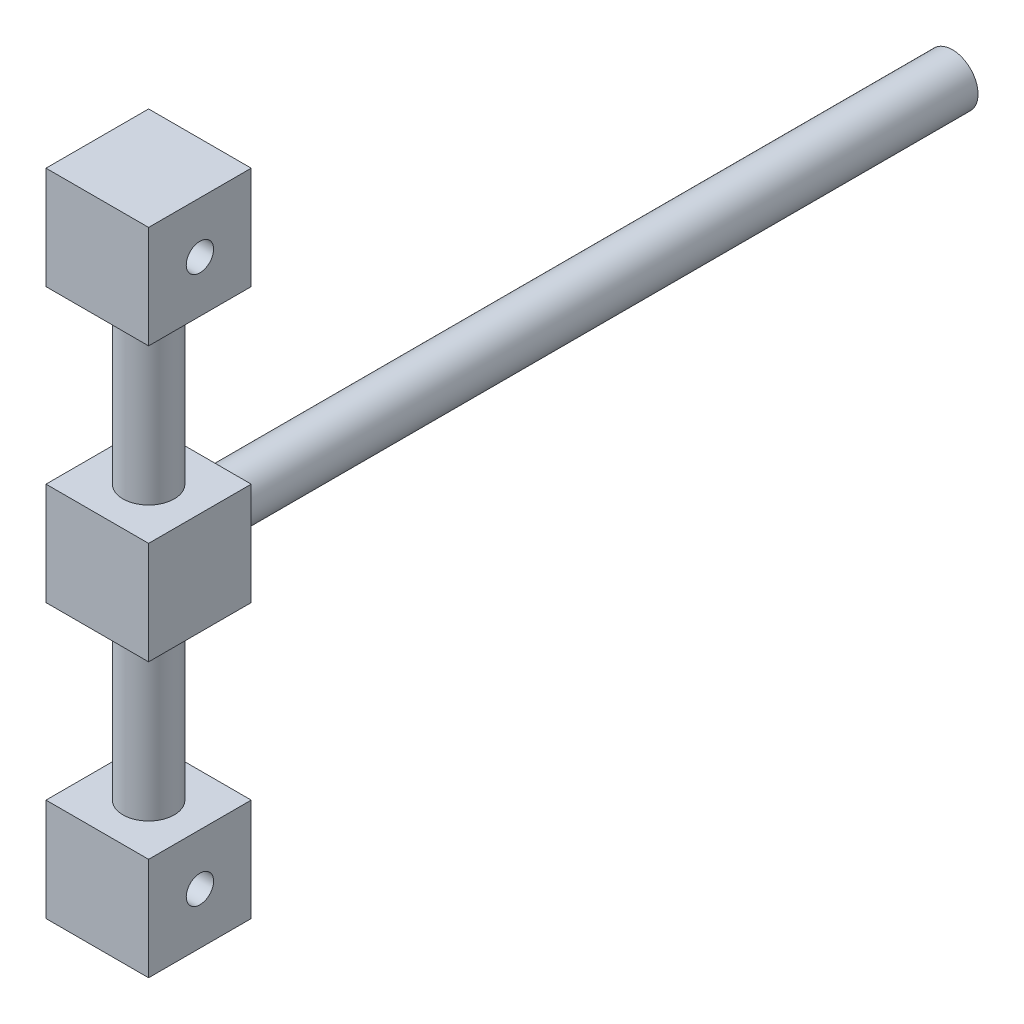
ISO-10303-21;
HEADER;
FILE_DESCRIPTION(('STEP AP214'),'2;1');
FILE_NAME('part.step','',(''),(''),'','','');
FILE_SCHEMA(('AUTOMOTIVE_DESIGN { 1 0 10303 214 1 1 1 1 }'));
ENDSEC;
DATA;
#1=APPLICATION_CONTEXT('core data for automotive mechanical design processes');
#2=APPLICATION_PROTOCOL_DEFINITION('international standard','automotive_design',2000,#1);
#3=PRODUCT_CONTEXT('',#1,'mechanical');
#4=PRODUCT('Part','Part','',(#3));
#5=PRODUCT_RELATED_PRODUCT_CATEGORY('part','',(#4));
#6=PRODUCT_DEFINITION_FORMATION('','',#4);
#7=PRODUCT_DEFINITION_CONTEXT('part definition',#1,'design');
#8=PRODUCT_DEFINITION('design','',#6,#7);
#9=PRODUCT_DEFINITION_SHAPE('','',#8);
#10=(LENGTH_UNIT() NAMED_UNIT(*) SI_UNIT(.MILLI.,.METRE.));
#11=(NAMED_UNIT(*) PLANE_ANGLE_UNIT() SI_UNIT($,.RADIAN.));
#12=(NAMED_UNIT(*) SI_UNIT($,.STERADIAN.) SOLID_ANGLE_UNIT());
#13=UNCERTAINTY_MEASURE_WITH_UNIT(LENGTH_MEASURE(1.E-05),#10,'distance_accuracy_value','');
#14=(GEOMETRIC_REPRESENTATION_CONTEXT(3) GLOBAL_UNCERTAINTY_ASSIGNED_CONTEXT((#13)) GLOBAL_UNIT_ASSIGNED_CONTEXT((#10,
#11,#12)) REPRESENTATION_CONTEXT('',''));
#15=CARTESIAN_POINT('',(0.,0.,0.));
#16=DIRECTION('',(0.,0.,1.));
#17=DIRECTION('',(1.,0.,0.));
#18=AXIS2_PLACEMENT_3D('',#15,#16,#17);
#19=CARTESIAN_POINT('',(-15.,-15.,30.));
#20=DIRECTION('',(1.,0.,0.));
#21=DIRECTION('',(0.,0.,-1.));
#22=AXIS2_PLACEMENT_3D('',#19,#20,#21);
#23=PLANE('',#22);
#24=DIRECTION('',(0.,-1.,0.));
#25=VECTOR('',#24,1.);
#26=CARTESIAN_POINT('',(-15.,-15.,0.));
#27=LINE('',#26,#25);
#28=CARTESIAN_POINT('',(-15.,15.,0.));
#29=VERTEX_POINT('',#28);
#30=CARTESIAN_POINT('',(-15.,-15.,0.));
#31=VERTEX_POINT('',#30);
#32=EDGE_CURVE('E226',#29,#31,#27,.T.);
#33=ORIENTED_EDGE('',*,*,#32,.T.);
#34=DIRECTION('',(0.,0.,-1.));
#35=VECTOR('',#34,1.);
#36=CARTESIAN_POINT('',(-15.,-15.,30.));
#37=LINE('',#36,#35);
#38=CARTESIAN_POINT('',(-15.,-15.,30.));
#39=VERTEX_POINT('',#38);
#40=EDGE_CURVE('E36',#39,#31,#37,.T.);
#41=ORIENTED_EDGE('',*,*,#40,.F.);
#42=DIRECTION('',(0.,-1.,0.));
#43=VECTOR('',#42,1.);
#44=CARTESIAN_POINT('',(-15.,-15.,30.));
#45=LINE('',#44,#43);
#46=CARTESIAN_POINT('',(-15.,15.,30.));
#47=VERTEX_POINT('',#46);
#48=EDGE_CURVE('E229',#47,#39,#45,.T.);
#49=ORIENTED_EDGE('',*,*,#48,.F.);
#50=DIRECTION('',(0.,0.,-1.));
#51=VECTOR('',#50,1.);
#52=CARTESIAN_POINT('',(-15.,15.,30.));
#53=LINE('',#52,#51);
#54=EDGE_CURVE('E235',#47,#29,#53,.T.);
#55=ORIENTED_EDGE('',*,*,#54,.T.);
#56=EDGE_LOOP('',(#33,#41,#49,#55));
#57=FACE_BOUND('',#56,.T.);
#58=ADVANCED_FACE('F33',(#57),#23,.F.);
#59=CARTESIAN_POINT('',(15.,-15.,30.));
#60=DIRECTION('',(0.,1.,0.));
#61=DIRECTION('',(-1.,0.,0.));
#62=AXIS2_PLACEMENT_3D('',#59,#60,#61);
#63=PLANE('',#62);
#64=CARTESIAN_POINT('',(0.,-15.,15.));
#65=DIRECTION('',(0.,-1.,0.));
#66=DIRECTION('',(1.,0.,0.));
#67=AXIS2_PLACEMENT_3D('',#64,#65,#66);
#68=CIRCLE('',#67,7.5);
#69=CARTESIAN_POINT('',(7.5,-15.,15.));
#70=VERTEX_POINT('',#69);
#71=EDGE_CURVE('E11',#70,#70,#68,.T.);
#72=ORIENTED_EDGE('',*,*,#71,.F.);
#73=EDGE_LOOP('',(#72));
#74=FACE_BOUND('',#73,.T.);
#75=DIRECTION('',(1.,0.,0.));
#76=VECTOR('',#75,1.);
#77=CARTESIAN_POINT('',(15.,-15.,0.));
#78=LINE('',#77,#76);
#79=CARTESIAN_POINT('',(15.,-15.,0.));
#80=VERTEX_POINT('',#79);
#81=EDGE_CURVE('E238',#31,#80,#78,.T.);
#82=ORIENTED_EDGE('',*,*,#81,.T.);
#83=DIRECTION('',(0.,0.,-1.));
#84=VECTOR('',#83,1.);
#85=CARTESIAN_POINT('',(15.,-15.,30.));
#86=LINE('',#85,#84);
#87=CARTESIAN_POINT('',(15.,-15.,30.));
#88=VERTEX_POINT('',#87);
#89=EDGE_CURVE('E244',#88,#80,#86,.T.);
#90=ORIENTED_EDGE('',*,*,#89,.F.);
#91=DIRECTION('',(1.,0.,0.));
#92=VECTOR('',#91,1.);
#93=CARTESIAN_POINT('',(15.,-15.,30.));
#94=LINE('',#93,#92);
#95=EDGE_CURVE('E83',#39,#88,#94,.T.);
#96=ORIENTED_EDGE('',*,*,#95,.F.);
#97=ORIENTED_EDGE('',*,*,#40,.T.);
#98=EDGE_LOOP('',(#82,#90,#96,#97));
#99=FACE_BOUND('',#98,.T.);
#100=ADVANCED_FACE('F247',(#74,#99),#63,.F.);
#101=CARTESIAN_POINT('',(15.,-15.,30.));
#102=DIRECTION('',(-1.,0.,0.));
#103=DIRECTION('',(0.,0.,1.));
#104=AXIS2_PLACEMENT_3D('',#101,#102,#103);
#105=PLANE('',#104);
#106=DIRECTION('',(0.,1.,0.));
#107=VECTOR('',#106,1.);
#108=CARTESIAN_POINT('',(15.,-15.,0.));
#109=LINE('',#108,#107);
#110=CARTESIAN_POINT('',(15.,15.,0.));
#111=VERTEX_POINT('',#110);
#112=EDGE_CURVE('E69',#80,#111,#109,.T.);
#113=ORIENTED_EDGE('',*,*,#112,.T.);
#114=DIRECTION('',(0.,0.,-1.));
#115=VECTOR('',#114,1.);
#116=CARTESIAN_POINT('',(15.,15.,30.));
#117=LINE('',#116,#115);
#118=CARTESIAN_POINT('',(15.,15.,30.));
#119=VERTEX_POINT('',#118);
#120=EDGE_CURVE('E243',#119,#111,#117,.T.);
#121=ORIENTED_EDGE('',*,*,#120,.F.);
#122=DIRECTION('',(0.,1.,0.));
#123=VECTOR('',#122,1.);
#124=CARTESIAN_POINT('',(15.,-15.,30.));
#125=LINE('',#124,#123);
#126=EDGE_CURVE('E232',#88,#119,#125,.T.);
#127=ORIENTED_EDGE('',*,*,#126,.F.);
#128=ORIENTED_EDGE('',*,*,#89,.T.);
#129=EDGE_LOOP('',(#113,#121,#127,#128));
#130=FACE_BOUND('',#129,.T.);
#131=ADVANCED_FACE('F273',(#130),#105,.F.);
#132=CARTESIAN_POINT('',(15.,15.,30.));
#133=DIRECTION('',(0.,-1.,0.));
#134=DIRECTION('',(1.,0.,0.));
#135=AXIS2_PLACEMENT_3D('',#132,#133,#134);
#136=PLANE('',#135);
#137=CARTESIAN_POINT('',(0.,15.,15.));
#138=DIRECTION('',(0.,-1.,0.));
#139=DIRECTION('',(1.,0.,0.));
#140=AXIS2_PLACEMENT_3D('',#137,#138,#139);
#141=CIRCLE('',#140,7.5);
#142=CARTESIAN_POINT('',(7.5,15.,15.));
#143=VERTEX_POINT('',#142);
#144=EDGE_CURVE('E181',#143,#143,#141,.T.);
#145=ORIENTED_EDGE('',*,*,#144,.T.);
#146=EDGE_LOOP('',(#145));
#147=FACE_BOUND('',#146,.T.);
#148=DIRECTION('',(-1.,0.,0.));
#149=VECTOR('',#148,1.);
#150=CARTESIAN_POINT('',(15.,15.,0.));
#151=LINE('',#150,#149);
#152=EDGE_CURVE('E75',#111,#29,#151,.T.);
#153=ORIENTED_EDGE('',*,*,#152,.T.);
#154=ORIENTED_EDGE('',*,*,#54,.F.);
#155=DIRECTION('',(-1.,0.,0.));
#156=VECTOR('',#155,1.);
#157=CARTESIAN_POINT('',(15.,15.,30.));
#158=LINE('',#157,#156);
#159=EDGE_CURVE('E51',#119,#47,#158,.T.);
#160=ORIENTED_EDGE('',*,*,#159,.F.);
#161=ORIENTED_EDGE('',*,*,#120,.T.);
#162=EDGE_LOOP('',(#153,#154,#160,#161));
#163=FACE_BOUND('',#162,.T.);
#164=ADVANCED_FACE('F265',(#147,#163),#136,.F.);
#165=CARTESIAN_POINT('',(0.,0.,30.));
#166=DIRECTION('',(0.,0.,1.));
#167=DIRECTION('',(1.,0.,0.));
#168=AXIS2_PLACEMENT_3D('',#165,#166,#167);
#169=PLANE('',#168);
#170=ORIENTED_EDGE('',*,*,#48,.T.);
#171=ORIENTED_EDGE('',*,*,#95,.T.);
#172=ORIENTED_EDGE('',*,*,#126,.T.);
#173=ORIENTED_EDGE('',*,*,#159,.T.);
#174=EDGE_LOOP('',(#170,#171,#172,#173));
#175=FACE_BOUND('',#174,.T.);
#176=ADVANCED_FACE('F255',(#175),#169,.T.);
#177=CARTESIAN_POINT('',(0.,0.,0.));
#178=DIRECTION('',(0.,0.,1.));
#179=DIRECTION('',(1.,0.,0.));
#180=AXIS2_PLACEMENT_3D('',#177,#178,#179);
#181=PLANE('',#180);
#182=CARTESIAN_POINT('',(0.,0.,0.));
#183=DIRECTION('',(0.,0.,-1.));
#184=DIRECTION('',(-1.,0.,0.));
#185=AXIS2_PLACEMENT_3D('',#182,#183,#184);
#186=CIRCLE('',#185,7.5);
#187=CARTESIAN_POINT('',(-7.5,0.,0.));
#188=VERTEX_POINT('',#187);
#189=EDGE_CURVE('E42',#188,#188,#186,.T.);
#190=ORIENTED_EDGE('',*,*,#189,.F.);
#191=EDGE_LOOP('',(#190));
#192=FACE_BOUND('',#191,.T.);
#193=ORIENTED_EDGE('',*,*,#32,.F.);
#194=ORIENTED_EDGE('',*,*,#152,.F.);
#195=ORIENTED_EDGE('',*,*,#112,.F.);
#196=ORIENTED_EDGE('',*,*,#81,.F.);
#197=EDGE_LOOP('',(#193,#194,#195,#196));
#198=FACE_BOUND('',#197,.T.);
#199=ADVANCED_FACE('F252',(#192,#198),#181,.F.);
#200=CARTESIAN_POINT('',(0.,0.,-220.));
#201=DIRECTION('',(0.,0.,1.));
#202=DIRECTION('',(1.,0.,0.));
#203=AXIS2_PLACEMENT_3D('',#200,#201,#202);
#204=CYLINDRICAL_SURFACE('',#203,7.5);
#205=CARTESIAN_POINT('',(0.,0.,-220.));
#206=DIRECTION('',(0.,0.,-1.));
#207=DIRECTION('',(-1.,0.,0.));
#208=AXIS2_PLACEMENT_3D('',#205,#206,#207);
#209=CIRCLE('',#208,7.5);
#210=CARTESIAN_POINT('',(-7.5,0.,-220.));
#211=VERTEX_POINT('',#210);
#212=EDGE_CURVE('E222',#211,#211,#209,.T.);
#213=ORIENTED_EDGE('',*,*,#212,.F.);
#214=EDGE_LOOP('',(#213));
#215=FACE_BOUND('',#214,.T.);
#216=ORIENTED_EDGE('',*,*,#189,.T.);
#217=EDGE_LOOP('',(#216));
#218=FACE_BOUND('',#217,.T.);
#219=ADVANCED_FACE('F254',(#215,#218),#204,.T.);
#220=CARTESIAN_POINT('',(0.,0.,-220.));
#221=DIRECTION('',(0.,0.,-1.));
#222=DIRECTION('',(-1.,0.,0.));
#223=AXIS2_PLACEMENT_3D('',#220,#221,#222);
#224=PLANE('',#223);
#225=ORIENTED_EDGE('',*,*,#212,.T.);
#226=EDGE_LOOP('',(#225));
#227=FACE_BOUND('',#226,.T.);
#228=ADVANCED_FACE('F262',(#227),#224,.T.);
#229=CARTESIAN_POINT('',(0.,-65.,15.));
#230=DIRECTION('',(0.,1.,0.));
#231=DIRECTION('',(-1.,0.,0.));
#232=AXIS2_PLACEMENT_3D('',#229,#230,#231);
#233=CYLINDRICAL_SURFACE('',#232,7.5);
#234=CARTESIAN_POINT('',(0.,-65.,15.));
#235=DIRECTION('',(0.,-1.,0.));
#236=DIRECTION('',(1.,0.,0.));
#237=AXIS2_PLACEMENT_3D('',#234,#235,#236);
#238=CIRCLE('',#237,7.5);
#239=CARTESIAN_POINT('',(7.50000000000001,-65.,15.));
#240=VERTEX_POINT('',#239);
#241=EDGE_CURVE('E220',#240,#240,#238,.T.);
#242=ORIENTED_EDGE('',*,*,#241,.F.);
#243=EDGE_LOOP('',(#242));
#244=FACE_BOUND('',#243,.T.);
#245=ORIENTED_EDGE('',*,*,#71,.T.);
#246=EDGE_LOOP('',(#245));
#247=FACE_BOUND('',#246,.T.);
#248=ADVANCED_FACE('F324',(#244,#247),#233,.T.);
#249=CARTESIAN_POINT('',(15.,-95.,30.));
#250=DIRECTION('',(-1.,0.,0.));
#251=DIRECTION('',(0.,-1.,0.));
#252=AXIS2_PLACEMENT_3D('',#249,#250,#251);
#253=PLANE('',#252);
#254=CARTESIAN_POINT('',(15.,-80.,15.));
#255=DIRECTION('',(-1.,0.,0.));
#256=DIRECTION('',(0.,-1.,0.));
#257=AXIS2_PLACEMENT_3D('',#254,#255,#256);
#258=CIRCLE('',#257,4.);
#259=CARTESIAN_POINT('',(15.,-84.,15.));
#260=VERTEX_POINT('',#259);
#261=EDGE_CURVE('E185',#260,#260,#258,.T.);
#262=ORIENTED_EDGE('',*,*,#261,.T.);
#263=EDGE_LOOP('',(#262));
#264=FACE_BOUND('',#263,.T.);
#265=DIRECTION('',(0.,0.,1.));
#266=VECTOR('',#265,1.);
#267=CARTESIAN_POINT('',(15.,-65.,30.));
#268=LINE('',#267,#266);
#269=CARTESIAN_POINT('',(15.,-65.,0.));
#270=VERTEX_POINT('',#269);
#271=CARTESIAN_POINT('',(15.,-65.,30.));
#272=VERTEX_POINT('',#271);
#273=EDGE_CURVE('E188',#270,#272,#268,.T.);
#274=ORIENTED_EDGE('',*,*,#273,.T.);
#275=DIRECTION('',(0.,1.,0.));
#276=VECTOR('',#275,1.);
#277=CARTESIAN_POINT('',(15.,-95.,30.));
#278=LINE('',#277,#276);
#279=CARTESIAN_POINT('',(15.,-95.,30.));
#280=VERTEX_POINT('',#279);
#281=EDGE_CURVE('E217',#280,#272,#278,.T.);
#282=ORIENTED_EDGE('',*,*,#281,.F.);
#283=DIRECTION('',(0.,0.,1.));
#284=VECTOR('',#283,1.);
#285=CARTESIAN_POINT('',(15.,-95.,30.));
#286=LINE('',#285,#284);
#287=CARTESIAN_POINT('',(15.,-95.,0.));
#288=VERTEX_POINT('',#287);
#289=EDGE_CURVE('E191',#288,#280,#286,.T.);
#290=ORIENTED_EDGE('',*,*,#289,.F.);
#291=DIRECTION('',(0.,1.,0.));
#292=VECTOR('',#291,1.);
#293=CARTESIAN_POINT('',(15.,-95.,0.));
#294=LINE('',#293,#292);
#295=EDGE_CURVE('E201',#288,#270,#294,.T.);
#296=ORIENTED_EDGE('',*,*,#295,.T.);
#297=EDGE_LOOP('',(#274,#282,#290,#296));
#298=FACE_BOUND('',#297,.T.);
#299=ADVANCED_FACE('F320',(#264,#298),#253,.F.);
#300=CARTESIAN_POINT('',(-15.,-95.,30.));
#301=DIRECTION('',(0.,0.,-1.));
#302=DIRECTION('',(-1.,0.,0.));
#303=AXIS2_PLACEMENT_3D('',#300,#301,#302);
#304=PLANE('',#303);
#305=DIRECTION('',(-1.,0.,0.));
#306=VECTOR('',#305,1.);
#307=CARTESIAN_POINT('',(-15.,-65.,30.));
#308=LINE('',#307,#306);
#309=CARTESIAN_POINT('',(-15.,-65.,30.));
#310=VERTEX_POINT('',#309);
#311=EDGE_CURVE('E204',#272,#310,#308,.T.);
#312=ORIENTED_EDGE('',*,*,#311,.T.);
#313=DIRECTION('',(0.,1.,0.));
#314=VECTOR('',#313,1.);
#315=CARTESIAN_POINT('',(-15.,-95.,30.));
#316=LINE('',#315,#314);
#317=CARTESIAN_POINT('',(-15.,-95.,30.));
#318=VERTEX_POINT('',#317);
#319=EDGE_CURVE('E214',#318,#310,#316,.T.);
#320=ORIENTED_EDGE('',*,*,#319,.F.);
#321=DIRECTION('',(-1.,0.,0.));
#322=VECTOR('',#321,1.);
#323=CARTESIAN_POINT('',(-15.,-95.,30.));
#324=LINE('',#323,#322);
#325=EDGE_CURVE('E194',#280,#318,#324,.T.);
#326=ORIENTED_EDGE('',*,*,#325,.F.);
#327=ORIENTED_EDGE('',*,*,#281,.T.);
#328=EDGE_LOOP('',(#312,#320,#326,#327));
#329=FACE_BOUND('',#328,.T.);
#330=ADVANCED_FACE('F316',(#329),#304,.F.);
#331=CARTESIAN_POINT('',(-15.,-95.,30.));
#332=DIRECTION('',(1.,0.,0.));
#333=DIRECTION('',(0.,1.,0.));
#334=AXIS2_PLACEMENT_3D('',#331,#332,#333);
#335=PLANE('',#334);
#336=CARTESIAN_POINT('',(-15.,-80.,15.));
#337=DIRECTION('',(-1.,0.,0.));
#338=DIRECTION('',(0.,-1.,0.));
#339=AXIS2_PLACEMENT_3D('',#336,#337,#338);
#340=CIRCLE('',#339,4.);
#341=CARTESIAN_POINT('',(-15.,-84.,15.));
#342=VERTEX_POINT('',#341);
#343=EDGE_CURVE('E184',#342,#342,#340,.T.);
#344=ORIENTED_EDGE('',*,*,#343,.F.);
#345=EDGE_LOOP('',(#344));
#346=FACE_BOUND('',#345,.T.);
#347=DIRECTION('',(0.,0.,-1.));
#348=VECTOR('',#347,1.);
#349=CARTESIAN_POINT('',(-15.,-65.,30.));
#350=LINE('',#349,#348);
#351=CARTESIAN_POINT('',(-15.,-65.,0.));
#352=VERTEX_POINT('',#351);
#353=EDGE_CURVE('E206',#310,#352,#350,.T.);
#354=ORIENTED_EDGE('',*,*,#353,.T.);
#355=DIRECTION('',(0.,1.,0.));
#356=VECTOR('',#355,1.);
#357=CARTESIAN_POINT('',(-15.,-95.,0.));
#358=LINE('',#357,#356);
#359=CARTESIAN_POINT('',(-15.,-95.,0.));
#360=VERTEX_POINT('',#359);
#361=EDGE_CURVE('E211',#360,#352,#358,.T.);
#362=ORIENTED_EDGE('',*,*,#361,.F.);
#363=DIRECTION('',(0.,0.,-1.));
#364=VECTOR('',#363,1.);
#365=CARTESIAN_POINT('',(-15.,-95.,30.));
#366=LINE('',#365,#364);
#367=EDGE_CURVE('E197',#318,#360,#366,.T.);
#368=ORIENTED_EDGE('',*,*,#367,.F.);
#369=ORIENTED_EDGE('',*,*,#319,.T.);
#370=EDGE_LOOP('',(#354,#362,#368,#369));
#371=FACE_BOUND('',#370,.T.);
#372=ADVANCED_FACE('F312',(#346,#371),#335,.F.);
#373=CARTESIAN_POINT('',(-15.,-95.,0.));
#374=DIRECTION('',(0.,0.,1.));
#375=DIRECTION('',(1.,0.,0.));
#376=AXIS2_PLACEMENT_3D('',#373,#374,#375);
#377=PLANE('',#376);
#378=DIRECTION('',(1.,0.,0.));
#379=VECTOR('',#378,1.);
#380=CARTESIAN_POINT('',(-15.,-65.,0.));
#381=LINE('',#380,#379);
#382=EDGE_CURVE('E195',#352,#270,#381,.T.);
#383=ORIENTED_EDGE('',*,*,#382,.T.);
#384=ORIENTED_EDGE('',*,*,#295,.F.);
#385=DIRECTION('',(1.,0.,0.));
#386=VECTOR('',#385,1.);
#387=CARTESIAN_POINT('',(-15.,-95.,0.));
#388=LINE('',#387,#386);
#389=EDGE_CURVE('E199',#360,#288,#388,.T.);
#390=ORIENTED_EDGE('',*,*,#389,.F.);
#391=ORIENTED_EDGE('',*,*,#361,.T.);
#392=EDGE_LOOP('',(#383,#384,#390,#391));
#393=FACE_BOUND('',#392,.T.);
#394=ADVANCED_FACE('F305',(#393),#377,.F.);
#395=CARTESIAN_POINT('',(0.,-95.,0.));
#396=DIRECTION('',(0.,-1.,0.));
#397=DIRECTION('',(0.,0.,-1.));
#398=AXIS2_PLACEMENT_3D('',#395,#396,#397);
#399=PLANE('',#398);
#400=ORIENTED_EDGE('',*,*,#289,.T.);
#401=ORIENTED_EDGE('',*,*,#325,.T.);
#402=ORIENTED_EDGE('',*,*,#367,.T.);
#403=ORIENTED_EDGE('',*,*,#389,.T.);
#404=EDGE_LOOP('',(#400,#401,#402,#403));
#405=FACE_BOUND('',#404,.T.);
#406=ADVANCED_FACE('F302',(#405),#399,.T.);
#407=CARTESIAN_POINT('',(0.,-65.,0.));
#408=DIRECTION('',(0.,-1.,0.));
#409=DIRECTION('',(0.,0.,-1.));
#410=AXIS2_PLACEMENT_3D('',#407,#408,#409);
#411=PLANE('',#410);
#412=ORIENTED_EDGE('',*,*,#241,.T.);
#413=EDGE_LOOP('',(#412));
#414=FACE_BOUND('',#413,.T.);
#415=ORIENTED_EDGE('',*,*,#273,.F.);
#416=ORIENTED_EDGE('',*,*,#382,.F.);
#417=ORIENTED_EDGE('',*,*,#353,.F.);
#418=ORIENTED_EDGE('',*,*,#311,.F.);
#419=EDGE_LOOP('',(#415,#416,#417,#418));
#420=FACE_BOUND('',#419,.T.);
#421=ADVANCED_FACE('F297',(#414,#420),#411,.F.);
#422=CARTESIAN_POINT('',(15.,-80.,15.));
#423=DIRECTION('',(-1.,0.,0.));
#424=DIRECTION('',(0.,-1.,0.));
#425=AXIS2_PLACEMENT_3D('',#422,#423,#424);
#426=CYLINDRICAL_SURFACE('',#425,4.);
#427=ORIENTED_EDGE('',*,*,#261,.F.);
#428=EDGE_LOOP('',(#427));
#429=FACE_BOUND('',#428,.T.);
#430=ORIENTED_EDGE('',*,*,#343,.T.);
#431=EDGE_LOOP('',(#430));
#432=FACE_BOUND('',#431,.T.);
#433=ADVANCED_FACE('F288',(#429,#432),#426,.F.);
#434=CARTESIAN_POINT('',(0.,65.,15.));
#435=DIRECTION('',(0.,-1.,0.));
#436=DIRECTION('',(1.,0.,0.));
#437=AXIS2_PLACEMENT_3D('',#434,#435,#436);
#438=CYLINDRICAL_SURFACE('',#437,7.5);
#439=CARTESIAN_POINT('',(0.,65.,15.));
#440=DIRECTION('',(0.,-1.,0.));
#441=DIRECTION('',(1.,0.,0.));
#442=AXIS2_PLACEMENT_3D('',#439,#440,#441);
#443=CIRCLE('',#442,7.5);
#444=CARTESIAN_POINT('',(7.50000000000001,65.,15.));
#445=VERTEX_POINT('',#444);
#446=EDGE_CURVE('E145',#445,#445,#443,.T.);
#447=ORIENTED_EDGE('',*,*,#446,.T.);
#448=EDGE_LOOP('',(#447));
#449=FACE_BOUND('',#448,.T.);
#450=ORIENTED_EDGE('',*,*,#144,.F.);
#451=EDGE_LOOP('',(#450));
#452=FACE_BOUND('',#451,.T.);
#453=ADVANCED_FACE('F286',(#449,#452),#438,.T.);
#454=CARTESIAN_POINT('',(15.,95.,30.));
#455=DIRECTION('',(1.,0.,0.));
#456=DIRECTION('',(0.,1.,0.));
#457=AXIS2_PLACEMENT_3D('',#454,#455,#456);
#458=PLANE('',#457);
#459=CARTESIAN_POINT('',(15.,80.,15.));
#460=DIRECTION('',(1.,0.,0.));
#461=DIRECTION('',(0.,1.,0.));
#462=AXIS2_PLACEMENT_3D('',#459,#460,#461);
#463=CIRCLE('',#462,4.);
#464=CARTESIAN_POINT('',(15.,84.,15.));
#465=VERTEX_POINT('',#464);
#466=EDGE_CURVE('E168',#465,#465,#463,.T.);
#467=ORIENTED_EDGE('',*,*,#466,.F.);
#468=EDGE_LOOP('',(#467));
#469=FACE_BOUND('',#468,.T.);
#470=DIRECTION('',(0.,0.,1.));
#471=VECTOR('',#470,1.);
#472=CARTESIAN_POINT('',(15.,65.,30.));
#473=LINE('',#472,#471);
#474=CARTESIAN_POINT('',(15.,65.,0.));
#475=VERTEX_POINT('',#474);
#476=CARTESIAN_POINT('',(15.,65.,30.));
#477=VERTEX_POINT('',#476);
#478=EDGE_CURVE('E140',#475,#477,#473,.T.);
#479=ORIENTED_EDGE('',*,*,#478,.F.);
#480=DIRECTION('',(0.,-1.,0.));
#481=VECTOR('',#480,1.);
#482=CARTESIAN_POINT('',(15.,95.,0.));
#483=LINE('',#482,#481);
#484=CARTESIAN_POINT('',(15.,95.,0.));
#485=VERTEX_POINT('',#484);
#486=EDGE_CURVE('E134',#485,#475,#483,.T.);
#487=ORIENTED_EDGE('',*,*,#486,.F.);
#488=DIRECTION('',(0.,0.,1.));
#489=VECTOR('',#488,1.);
#490=CARTESIAN_POINT('',(15.,95.,30.));
#491=LINE('',#490,#489);
#492=CARTESIAN_POINT('',(15.,95.,30.));
#493=VERTEX_POINT('',#492);
#494=EDGE_CURVE('E137',#485,#493,#491,.T.);
#495=ORIENTED_EDGE('',*,*,#494,.T.);
#496=DIRECTION('',(0.,-1.,0.));
#497=VECTOR('',#496,1.);
#498=CARTESIAN_POINT('',(15.,95.,30.));
#499=LINE('',#498,#497);
#500=EDGE_CURVE('E165',#493,#477,#499,.T.);
#501=ORIENTED_EDGE('',*,*,#500,.T.);
#502=EDGE_LOOP('',(#479,#487,#495,#501));
#503=FACE_BOUND('',#502,.T.);
#504=ADVANCED_FACE('F136',(#469,#503),#458,.T.);
#505=CARTESIAN_POINT('',(-15.,95.,0.));
#506=DIRECTION('',(0.,0.,-1.));
#507=DIRECTION('',(-1.,0.,0.));
#508=AXIS2_PLACEMENT_3D('',#505,#506,#507);
#509=PLANE('',#508);
#510=DIRECTION('',(1.,0.,0.));
#511=VECTOR('',#510,1.);
#512=CARTESIAN_POINT('',(-15.,65.,0.));
#513=LINE('',#512,#511);
#514=CARTESIAN_POINT('',(-15.,65.,0.));
#515=VERTEX_POINT('',#514);
#516=EDGE_CURVE('E167',#515,#475,#513,.T.);
#517=ORIENTED_EDGE('',*,*,#516,.F.);
#518=DIRECTION('',(0.,-1.,0.));
#519=VECTOR('',#518,1.);
#520=CARTESIAN_POINT('',(-15.,95.,0.));
#521=LINE('',#520,#519);
#522=CARTESIAN_POINT('',(-15.,95.,0.));
#523=VERTEX_POINT('',#522);
#524=EDGE_CURVE('E146',#523,#515,#521,.T.);
#525=ORIENTED_EDGE('',*,*,#524,.F.);
#526=DIRECTION('',(1.,0.,0.));
#527=VECTOR('',#526,1.);
#528=CARTESIAN_POINT('',(-15.,95.,0.));
#529=LINE('',#528,#527);
#530=EDGE_CURVE('E152',#523,#485,#529,.T.);
#531=ORIENTED_EDGE('',*,*,#530,.T.);
#532=ORIENTED_EDGE('',*,*,#486,.T.);
#533=EDGE_LOOP('',(#517,#525,#531,#532));
#534=FACE_BOUND('',#533,.T.);
#535=ADVANCED_FACE('F158',(#534),#509,.T.);
#536=CARTESIAN_POINT('',(-15.,95.,30.));
#537=DIRECTION('',(-1.,0.,0.));
#538=DIRECTION('',(0.,-1.,0.));
#539=AXIS2_PLACEMENT_3D('',#536,#537,#538);
#540=PLANE('',#539);
#541=CARTESIAN_POINT('',(-15.,80.,15.));
#542=DIRECTION('',(1.,0.,0.));
#543=DIRECTION('',(0.,1.,0.));
#544=AXIS2_PLACEMENT_3D('',#541,#542,#543);
#545=CIRCLE('',#544,4.);
#546=CARTESIAN_POINT('',(-15.,84.,15.));
#547=VERTEX_POINT('',#546);
#548=EDGE_CURVE('E449',#547,#547,#545,.T.);
#549=ORIENTED_EDGE('',*,*,#548,.T.);
#550=EDGE_LOOP('',(#549));
#551=FACE_BOUND('',#550,.T.);
#552=DIRECTION('',(0.,0.,-1.));
#553=VECTOR('',#552,1.);
#554=CARTESIAN_POINT('',(-15.,65.,30.));
#555=LINE('',#554,#553);
#556=CARTESIAN_POINT('',(-15.,65.,30.));
#557=VERTEX_POINT('',#556);
#558=EDGE_CURVE('E170',#557,#515,#555,.T.);
#559=ORIENTED_EDGE('',*,*,#558,.F.);
#560=DIRECTION('',(0.,-1.,0.));
#561=VECTOR('',#560,1.);
#562=CARTESIAN_POINT('',(-15.,95.,30.));
#563=LINE('',#562,#561);
#564=CARTESIAN_POINT('',(-15.,95.,30.));
#565=VERTEX_POINT('',#564);
#566=EDGE_CURVE('E176',#565,#557,#563,.T.);
#567=ORIENTED_EDGE('',*,*,#566,.F.);
#568=DIRECTION('',(0.,0.,-1.));
#569=VECTOR('',#568,1.);
#570=CARTESIAN_POINT('',(-15.,95.,30.));
#571=LINE('',#570,#569);
#572=EDGE_CURVE('E159',#565,#523,#571,.T.);
#573=ORIENTED_EDGE('',*,*,#572,.T.);
#574=ORIENTED_EDGE('',*,*,#524,.T.);
#575=EDGE_LOOP('',(#559,#567,#573,#574));
#576=FACE_BOUND('',#575,.T.);
#577=ADVANCED_FACE('F394',(#551,#576),#540,.T.);
#578=CARTESIAN_POINT('',(-15.,95.,30.));
#579=DIRECTION('',(0.,0.,1.));
#580=DIRECTION('',(1.,0.,0.));
#581=AXIS2_PLACEMENT_3D('',#578,#579,#580);
#582=PLANE('',#581);
#583=DIRECTION('',(-1.,0.,0.));
#584=VECTOR('',#583,1.);
#585=CARTESIAN_POINT('',(-15.,65.,30.));
#586=LINE('',#585,#584);
#587=EDGE_CURVE('E156',#477,#557,#586,.T.);
#588=ORIENTED_EDGE('',*,*,#587,.F.);
#589=ORIENTED_EDGE('',*,*,#500,.F.);
#590=DIRECTION('',(-1.,0.,0.));
#591=VECTOR('',#590,1.);
#592=CARTESIAN_POINT('',(-15.,95.,30.));
#593=LINE('',#592,#591);
#594=EDGE_CURVE('E155',#493,#565,#593,.T.);
#595=ORIENTED_EDGE('',*,*,#594,.T.);
#596=ORIENTED_EDGE('',*,*,#566,.T.);
#597=EDGE_LOOP('',(#588,#589,#595,#596));
#598=FACE_BOUND('',#597,.T.);
#599=ADVANCED_FACE('F402',(#598),#582,.T.);
#600=CARTESIAN_POINT('',(0.,95.,0.));
#601=DIRECTION('',(0.,1.,0.));
#602=DIRECTION('',(0.,0.,-1.));
#603=AXIS2_PLACEMENT_3D('',#600,#601,#602);
#604=PLANE('',#603);
#605=ORIENTED_EDGE('',*,*,#494,.F.);
#606=ORIENTED_EDGE('',*,*,#530,.F.);
#607=ORIENTED_EDGE('',*,*,#572,.F.);
#608=ORIENTED_EDGE('',*,*,#594,.F.);
#609=EDGE_LOOP('',(#605,#606,#607,#608));
#610=FACE_BOUND('',#609,.T.);
#611=ADVANCED_FACE('F150',(#610),#604,.T.);
#612=CARTESIAN_POINT('',(0.,65.,0.));
#613=DIRECTION('',(0.,1.,0.));
#614=DIRECTION('',(0.,0.,-1.));
#615=AXIS2_PLACEMENT_3D('',#612,#613,#614);
#616=PLANE('',#615);
#617=ORIENTED_EDGE('',*,*,#446,.F.);
#618=EDGE_LOOP('',(#617));
#619=FACE_BOUND('',#618,.T.);
#620=ORIENTED_EDGE('',*,*,#478,.T.);
#621=ORIENTED_EDGE('',*,*,#587,.T.);
#622=ORIENTED_EDGE('',*,*,#558,.T.);
#623=ORIENTED_EDGE('',*,*,#516,.T.);
#624=EDGE_LOOP('',(#620,#621,#622,#623));
#625=FACE_BOUND('',#624,.T.);
#626=ADVANCED_FACE('F421',(#619,#625),#616,.F.);
#627=CARTESIAN_POINT('',(15.,80.,15.));
#628=DIRECTION('',(-1.,0.,0.));
#629=DIRECTION('',(0.,-1.,0.));
#630=AXIS2_PLACEMENT_3D('',#627,#628,#629);
#631=CYLINDRICAL_SURFACE('',#630,4.);
#632=ORIENTED_EDGE('',*,*,#466,.T.);
#633=EDGE_LOOP('',(#632));
#634=FACE_BOUND('',#633,.T.);
#635=ORIENTED_EDGE('',*,*,#548,.F.);
#636=EDGE_LOOP('',(#635));
#637=FACE_BOUND('',#636,.T.);
#638=ADVANCED_FACE('F430',(#634,#637),#631,.F.);
#639=CLOSED_SHELL('',(#58,#100,#131,#164,#176,#199,#219,#228,#248,#299,#330,#372,#394,#406,#421,
#433,#453,#504,#535,#577,#599,#611,#626,#638));
#640=MANIFOLD_SOLID_BREP('B2',#639);
#641=ADVANCED_BREP_SHAPE_REPRESENTATION('',(#18,#640),#14);
#642=SHAPE_DEFINITION_REPRESENTATION(#9,#641);
ENDSEC;
END-ISO-10303-21;
